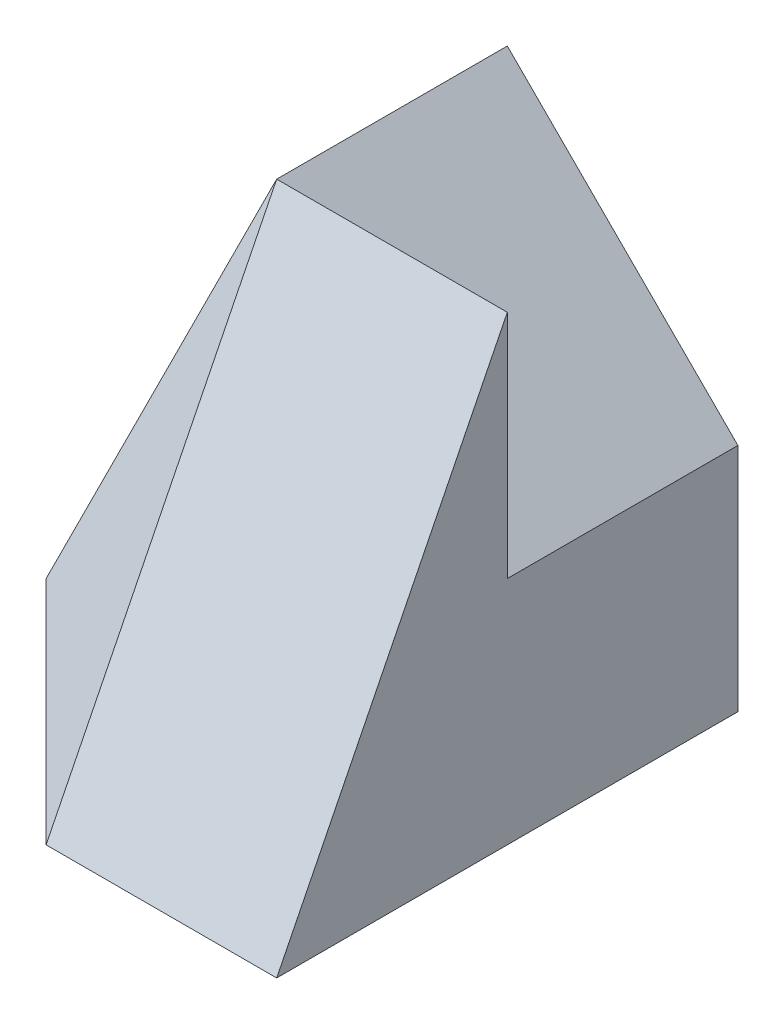
ISO-10303-21;
HEADER;
FILE_DESCRIPTION(('STEP AP214'),'2;1');
FILE_NAME('part.step','',(''),(''),'','','');
FILE_SCHEMA(('AUTOMOTIVE_DESIGN { 1 0 10303 214 1 1 1 1 }'));
ENDSEC;
DATA;
#1=APPLICATION_CONTEXT('core data for automotive mechanical design processes');
#2=APPLICATION_PROTOCOL_DEFINITION('international standard','automotive_design',2000,#1);
#3=PRODUCT_CONTEXT('',#1,'mechanical');
#4=PRODUCT('Part','Part','',(#3));
#5=PRODUCT_RELATED_PRODUCT_CATEGORY('part','',(#4));
#6=PRODUCT_DEFINITION_FORMATION('','',#4);
#7=PRODUCT_DEFINITION_CONTEXT('part definition',#1,'design');
#8=PRODUCT_DEFINITION('design','',#6,#7);
#9=PRODUCT_DEFINITION_SHAPE('','',#8);
#10=(LENGTH_UNIT() NAMED_UNIT(*) SI_UNIT(.MILLI.,.METRE.));
#11=(NAMED_UNIT(*) PLANE_ANGLE_UNIT() SI_UNIT($,.RADIAN.));
#12=(NAMED_UNIT(*) SI_UNIT($,.STERADIAN.) SOLID_ANGLE_UNIT());
#13=UNCERTAINTY_MEASURE_WITH_UNIT(LENGTH_MEASURE(1.E-05),#10,'distance_accuracy_value','');
#14=(GEOMETRIC_REPRESENTATION_CONTEXT(3) GLOBAL_UNCERTAINTY_ASSIGNED_CONTEXT((#13)) GLOBAL_UNIT_ASSIGNED_CONTEXT((#10,
#11,#12)) REPRESENTATION_CONTEXT('',''));
#15=CARTESIAN_POINT('',(0.,0.,0.));
#16=DIRECTION('',(0.,0.,1.));
#17=DIRECTION('',(1.,0.,0.));
#18=AXIS2_PLACEMENT_3D('',#15,#16,#17);
#19=CARTESIAN_POINT('',(0.,0.,40.));
#20=DIRECTION('',(0.,1.,0.));
#21=DIRECTION('',(0.,0.,1.));
#22=AXIS2_PLACEMENT_3D('',#19,#20,#21);
#23=PLANE('',#22);
#24=DIRECTION('',(1.,0.,0.));
#25=VECTOR('',#24,1.);
#26=CARTESIAN_POINT('',(0.,0.,40.));
#27=LINE('',#26,#25);
#28=CARTESIAN_POINT('',(0.,0.,40.));
#29=VERTEX_POINT('',#28);
#30=CARTESIAN_POINT('',(20.,0.,40.));
#31=VERTEX_POINT('',#30);
#32=EDGE_CURVE('E41',#29,#31,#27,.T.);
#33=ORIENTED_EDGE('',*,*,#32,.F.);
#34=DIRECTION('',(-0.707106781186547,0.,-0.707106781186548));
#35=VECTOR('',#34,1.);
#36=CARTESIAN_POINT('',(-20.,0.,20.));
#37=LINE('',#36,#35);
#38=CARTESIAN_POINT('',(-20.,0.,20.));
#39=VERTEX_POINT('',#38);
#40=EDGE_CURVE('E80',#29,#39,#37,.T.);
#41=ORIENTED_EDGE('',*,*,#40,.T.);
#42=DIRECTION('',(0.,0.,-1.));
#43=VECTOR('',#42,1.);
#44=CARTESIAN_POINT('',(-20.,0.,20.));
#45=LINE('',#44,#43);
#46=CARTESIAN_POINT('',(-20.,0.,0.));
#47=VERTEX_POINT('',#46);
#48=EDGE_CURVE('E83',#39,#47,#45,.T.);
#49=ORIENTED_EDGE('',*,*,#48,.T.);
#50=DIRECTION('',(1.,0.,0.));
#51=VECTOR('',#50,1.);
#52=CARTESIAN_POINT('',(0.,0.,0.));
#53=LINE('',#52,#51);
#54=CARTESIAN_POINT('',(20.,0.,0.));
#55=VERTEX_POINT('',#54);
#56=EDGE_CURVE('E49',#47,#55,#53,.T.);
#57=ORIENTED_EDGE('',*,*,#56,.T.);
#58=DIRECTION('',(0.,0.,-1.));
#59=VECTOR('',#58,1.);
#60=CARTESIAN_POINT('',(20.,0.,40.));
#61=LINE('',#60,#59);
#62=EDGE_CURVE('E11',#31,#55,#61,.T.);
#63=ORIENTED_EDGE('',*,*,#62,.F.);
#64=EDGE_LOOP('',(#33,#41,#49,#57,#63));
#65=FACE_BOUND('',#64,.T.);
#66=ADVANCED_FACE('F33',(#65),#23,.F.);
#67=CARTESIAN_POINT('',(0.,40.,20.));
#68=DIRECTION('',(-0.707106781186548,-0.707106781186548,0.));
#69=DIRECTION('',(0.707106781186548,-0.707106781186548,0.));
#70=AXIS2_PLACEMENT_3D('',#67,#68,#69);
#71=PLANE('',#70);
#72=DIRECTION('',(0.,0.,-1.));
#73=VECTOR('',#72,1.);
#74=CARTESIAN_POINT('',(0.,40.,20.));
#75=LINE('',#74,#73);
#76=CARTESIAN_POINT('',(0.,40.,20.));
#77=VERTEX_POINT('',#76);
#78=CARTESIAN_POINT('',(0.,40.,0.));
#79=VERTEX_POINT('',#78);
#80=EDGE_CURVE('E98',#77,#79,#75,.T.);
#81=ORIENTED_EDGE('',*,*,#80,.F.);
#82=DIRECTION('',(-0.707106781186548,0.707106781186548,0.));
#83=VECTOR('',#82,1.);
#84=CARTESIAN_POINT('',(0.,40.,20.));
#85=LINE('',#84,#83);
#86=CARTESIAN_POINT('',(20.,20.,20.));
#87=VERTEX_POINT('',#86);
#88=EDGE_CURVE('E119',#87,#77,#85,.T.);
#89=ORIENTED_EDGE('',*,*,#88,.F.);
#90=DIRECTION('',(0.,0.,-1.));
#91=VECTOR('',#90,1.);
#92=CARTESIAN_POINT('',(20.,20.,20.));
#93=LINE('',#92,#91);
#94=CARTESIAN_POINT('',(20.,20.,0.));
#95=VERTEX_POINT('',#94);
#96=EDGE_CURVE('E122',#87,#95,#93,.T.);
#97=ORIENTED_EDGE('',*,*,#96,.T.);
#98=DIRECTION('',(-0.707106781186548,0.707106781186548,0.));
#99=VECTOR('',#98,1.);
#100=CARTESIAN_POINT('',(0.,40.,0.));
#101=LINE('',#100,#99);
#102=EDGE_CURVE('E56',#95,#79,#101,.T.);
#103=ORIENTED_EDGE('',*,*,#102,.T.);
#104=EDGE_LOOP('',(#81,#89,#97,#103));
#105=FACE_BOUND('',#104,.T.);
#106=ADVANCED_FACE('F140',(#105),#71,.F.);
#107=CARTESIAN_POINT('',(20.,0.,40.));
#108=DIRECTION('',(-1.,0.,0.));
#109=DIRECTION('',(0.,0.,1.));
#110=AXIS2_PLACEMENT_3D('',#107,#108,#109);
#111=PLANE('',#110);
#112=DIRECTION('',(0.,-1.,0.));
#113=VECTOR('',#112,1.);
#114=CARTESIAN_POINT('',(20.,20.,20.));
#115=LINE('',#114,#113);
#116=CARTESIAN_POINT('',(20.,40.,20.));
#117=VERTEX_POINT('',#116);
#118=EDGE_CURVE('E116',#117,#87,#115,.T.);
#119=ORIENTED_EDGE('',*,*,#118,.F.);
#120=DIRECTION('',(0.,-0.894427190999916,0.447213595499958));
#121=VECTOR('',#120,1.);
#122=CARTESIAN_POINT('',(20.,16.,32.));
#123=LINE('',#122,#121);
#124=EDGE_CURVE('E124',#117,#31,#123,.T.);
#125=ORIENTED_EDGE('',*,*,#124,.T.);
#126=ORIENTED_EDGE('',*,*,#62,.T.);
#127=DIRECTION('',(0.,1.,0.));
#128=VECTOR('',#127,1.);
#129=CARTESIAN_POINT('',(20.,0.,0.));
#130=LINE('',#129,#128);
#131=EDGE_CURVE('E105',#55,#95,#130,.T.);
#132=ORIENTED_EDGE('',*,*,#131,.T.);
#133=ORIENTED_EDGE('',*,*,#96,.F.);
#134=EDGE_LOOP('',(#119,#125,#126,#132,#133));
#135=FACE_BOUND('',#134,.T.);
#136=ADVANCED_FACE('F137',(#135),#111,.F.);
#137=CARTESIAN_POINT('',(0.,0.,0.));
#138=DIRECTION('',(0.,0.,-1.));
#139=DIRECTION('',(-1.,0.,0.));
#140=AXIS2_PLACEMENT_3D('',#137,#138,#139);
#141=PLANE('',#140);
#142=ORIENTED_EDGE('',*,*,#102,.F.);
#143=ORIENTED_EDGE('',*,*,#131,.F.);
#144=ORIENTED_EDGE('',*,*,#56,.F.);
#145=DIRECTION('',(0.447213595499958,0.894427190999916,0.));
#146=VECTOR('',#145,1.);
#147=CARTESIAN_POINT('',(-20.,0.,0.));
#148=LINE('',#147,#146);
#149=EDGE_CURVE('E94',#47,#79,#148,.T.);
#150=ORIENTED_EDGE('',*,*,#149,.T.);
#151=EDGE_LOOP('',(#142,#143,#144,#150));
#152=FACE_BOUND('',#151,.T.);
#153=ADVANCED_FACE('F135',(#152),#141,.T.);
#154=CARTESIAN_POINT('',(-20.,0.,20.));
#155=DIRECTION('',(-0.894427190999916,0.447213595499958,0.));
#156=DIRECTION('',(-0.447213595499958,-0.894427190999916,0.));
#157=AXIS2_PLACEMENT_3D('',#154,#155,#156);
#158=PLANE('',#157);
#159=ORIENTED_EDGE('',*,*,#149,.F.);
#160=ORIENTED_EDGE('',*,*,#48,.F.);
#161=DIRECTION('',(0.447213595499958,0.894427190999916,0.));
#162=VECTOR('',#161,1.);
#163=CARTESIAN_POINT('',(-20.,0.,20.));
#164=LINE('',#163,#162);
#165=EDGE_CURVE('E90',#39,#77,#164,.T.);
#166=ORIENTED_EDGE('',*,*,#165,.T.);
#167=ORIENTED_EDGE('',*,*,#80,.T.);
#168=EDGE_LOOP('',(#159,#160,#166,#167));
#169=FACE_BOUND('',#168,.T.);
#170=ADVANCED_FACE('F96',(#169),#158,.T.);
#171=CARTESIAN_POINT('',(0.,0.,20.));
#172=DIRECTION('',(0.,0.,-1.));
#173=DIRECTION('',(-1.,0.,0.));
#174=AXIS2_PLACEMENT_3D('',#171,#172,#173);
#175=PLANE('',#174);
#176=DIRECTION('',(1.,0.,0.));
#177=VECTOR('',#176,1.);
#178=CARTESIAN_POINT('',(20.,40.,20.));
#179=LINE('',#178,#177);
#180=EDGE_CURVE('E113',#77,#117,#179,.T.);
#181=ORIENTED_EDGE('',*,*,#180,.T.);
#182=ORIENTED_EDGE('',*,*,#118,.T.);
#183=ORIENTED_EDGE('',*,*,#88,.T.);
#184=EDGE_LOOP('',(#181,#182,#183));
#185=FACE_BOUND('',#184,.T.);
#186=ADVANCED_FACE('F139',(#185),#175,.T.);
#187=CARTESIAN_POINT('',(20.,16.,32.));
#188=DIRECTION('',(0.,-0.447213595499958,-0.894427190999916));
#189=DIRECTION('',(0.,0.894427190999916,-0.447213595499958));
#190=AXIS2_PLACEMENT_3D('',#187,#188,#189);
#191=PLANE('',#190);
#192=DIRECTION('',(0.,-0.894427190999916,0.447213595499958));
#193=VECTOR('',#192,1.);
#194=CARTESIAN_POINT('',(0.,16.,32.));
#195=LINE('',#194,#193);
#196=EDGE_CURVE('E87',#77,#29,#195,.T.);
#197=ORIENTED_EDGE('',*,*,#196,.T.);
#198=ORIENTED_EDGE('',*,*,#32,.T.);
#199=ORIENTED_EDGE('',*,*,#124,.F.);
#200=ORIENTED_EDGE('',*,*,#180,.F.);
#201=EDGE_LOOP('',(#197,#198,#199,#200));
#202=FACE_BOUND('',#201,.T.);
#203=ADVANCED_FACE('F169',(#202),#191,.F.);
#204=CARTESIAN_POINT('',(-17.7777777777778,8.8888888888889,17.7777777777778));
#205=DIRECTION('',(0.666666666666667,-0.333333333333333,-0.666666666666667));
#206=DIRECTION('',(-0.707106781186547,0.,-0.707106781186548));
#207=AXIS2_PLACEMENT_3D('',#204,#205,#206);
#208=PLANE('',#207);
#209=ORIENTED_EDGE('',*,*,#196,.F.);
#210=ORIENTED_EDGE('',*,*,#165,.F.);
#211=ORIENTED_EDGE('',*,*,#40,.F.);
#212=EDGE_LOOP('',(#209,#210,#211));
#213=FACE_BOUND('',#212,.T.);
#214=ADVANCED_FACE('F91',(#213),#208,.F.);
#215=CLOSED_SHELL('',(#66,#106,#136,#153,#170,#186,#203,#214));
#216=MANIFOLD_SOLID_BREP('B2',#215);
#217=ADVANCED_BREP_SHAPE_REPRESENTATION('',(#18,#216),#14);
#218=SHAPE_DEFINITION_REPRESENTATION(#9,#217);
ENDSEC;
END-ISO-10303-21;
